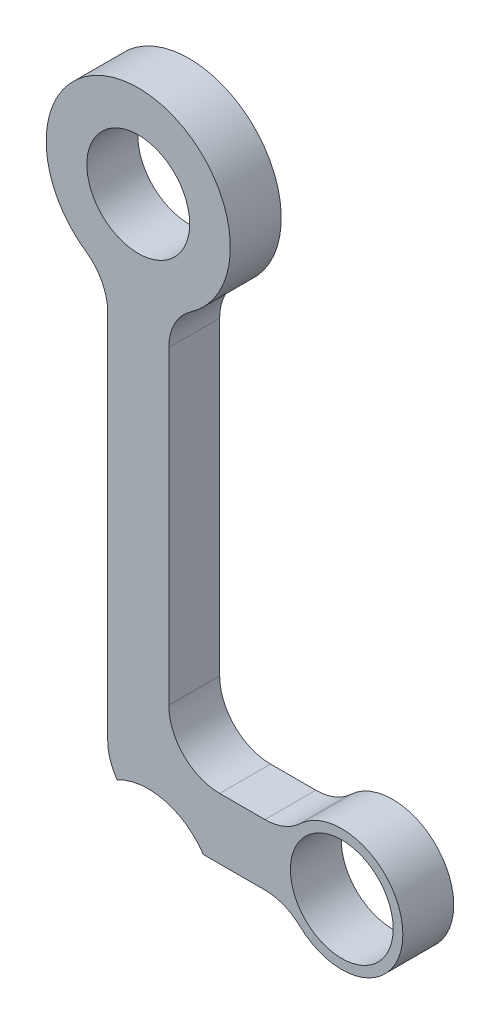
ISO-10303-21;
HEADER;
FILE_DESCRIPTION(('STEP AP214'),'2;1');
FILE_NAME('part.step','',(''),(''),'','','');
FILE_SCHEMA(('AUTOMOTIVE_DESIGN { 1 0 10303 214 1 1 1 1 }'));
ENDSEC;
DATA;
#1=APPLICATION_CONTEXT('core data for automotive mechanical design processes');
#2=APPLICATION_PROTOCOL_DEFINITION('international standard','automotive_design',2000,#1);
#3=PRODUCT_CONTEXT('',#1,'mechanical');
#4=PRODUCT('Part','Part','',(#3));
#5=PRODUCT_RELATED_PRODUCT_CATEGORY('part','',(#4));
#6=PRODUCT_DEFINITION_FORMATION('','',#4);
#7=PRODUCT_DEFINITION_CONTEXT('part definition',#1,'design');
#8=PRODUCT_DEFINITION('design','',#6,#7);
#9=PRODUCT_DEFINITION_SHAPE('','',#8);
#10=(LENGTH_UNIT() NAMED_UNIT(*) SI_UNIT(.MILLI.,.METRE.));
#11=(NAMED_UNIT(*) PLANE_ANGLE_UNIT() SI_UNIT($,.RADIAN.));
#12=(NAMED_UNIT(*) SI_UNIT($,.STERADIAN.) SOLID_ANGLE_UNIT());
#13=UNCERTAINTY_MEASURE_WITH_UNIT(LENGTH_MEASURE(1.E-05),#10,'distance_accuracy_value','');
#14=(GEOMETRIC_REPRESENTATION_CONTEXT(3) GLOBAL_UNCERTAINTY_ASSIGNED_CONTEXT((#13)) GLOBAL_UNIT_ASSIGNED_CONTEXT((#10,
#11,#12)) REPRESENTATION_CONTEXT('',''));
#15=CARTESIAN_POINT('',(0.,0.,0.));
#16=DIRECTION('',(0.,0.,1.));
#17=DIRECTION('',(1.,0.,0.));
#18=AXIS2_PLACEMENT_3D('',#15,#16,#17);
#19=CARTESIAN_POINT('',(10.16,-53.34,6.35));
#20=DIRECTION('',(0.,0.,-1.));
#21=DIRECTION('',(-1.,0.,0.));
#22=AXIS2_PLACEMENT_3D('',#19,#20,#21);
#23=PLANE('',#22);
#24=CARTESIAN_POINT('',(2.54000000000001,-60.96,6.35));
#25=DIRECTION('',(0.,0.,1.));
#26=DIRECTION('',(1.,0.,0.));
#27=AXIS2_PLACEMENT_3D('',#24,#25,#26);
#28=CIRCLE('',#27,6.35);
#29=CARTESIAN_POINT('',(-3.80999999999999,-60.96,6.35));
#30=VERTEX_POINT('',#29);
#31=CARTESIAN_POINT('',(-2.64725321506776,-64.6226362203704,6.35));
#32=VERTEX_POINT('',#31);
#33=EDGE_CURVE('E277',#30,#32,#28,.T.);
#34=ORIENTED_EDGE('',*,*,#33,.T.);
#35=CARTESIAN_POINT('',(1.25406511255299,-71.8975754164441,6.35));
#36=DIRECTION('',(0.,0.,-1.));
#37=DIRECTION('',(-1.,0.,0.));
#38=AXIS2_PLACEMENT_3D('',#35,#36,#37);
#39=CIRCLE('',#38,8.255);
#40=CARTESIAN_POINT('',(8.11694911262448,-67.31,6.35));
#41=VERTEX_POINT('',#40);
#42=EDGE_CURVE('E287',#32,#41,#39,.T.);
#43=ORIENTED_EDGE('',*,*,#42,.T.);
#44=DIRECTION('',(1.,0.,0.));
#45=VECTOR('',#44,1.);
#46=CARTESIAN_POINT('',(2.54000000000001,-67.31,6.35));
#47=LINE('',#46,#45);
#48=CARTESIAN_POINT('',(15.8117102672061,-67.31,6.35));
#49=VERTEX_POINT('',#48);
#50=EDGE_CURVE('E280',#41,#49,#47,.T.);
#51=ORIENTED_EDGE('',*,*,#50,.T.);
#52=CARTESIAN_POINT('',(15.8117102672061,-73.66,6.35));
#53=DIRECTION('',(0.,0.,-1.));
#54=DIRECTION('',(-1.,0.,0.));
#55=AXIS2_PLACEMENT_3D('',#52,#53,#54);
#56=CIRCLE('',#55,6.34999999999999);
#57=CARTESIAN_POINT('',(20.1700237821124,-69.0418181818182,6.35));
#58=VERTEX_POINT('',#57);
#59=EDGE_CURVE('E150',#49,#58,#56,.T.);
#60=ORIENTED_EDGE('',*,*,#59,.T.);
#61=CARTESIAN_POINT('',(25.4,-63.5,6.35));
#62=DIRECTION('',(0.,0.,1.));
#63=DIRECTION('',(1.,0.,0.));
#64=AXIS2_PLACEMENT_3D('',#61,#62,#63);
#65=CIRCLE('',#64,7.62);
#66=CARTESIAN_POINT('',(20.1700237821125,-57.9581818181818,6.35));
#67=VERTEX_POINT('',#66);
#68=EDGE_CURVE('E142',#58,#67,#65,.T.);
#69=ORIENTED_EDGE('',*,*,#68,.T.);
#70=CARTESIAN_POINT('',(15.8117102672062,-53.34,6.35));
#71=DIRECTION('',(0.,0.,-1.));
#72=DIRECTION('',(1.,0.,0.));
#73=AXIS2_PLACEMENT_3D('',#70,#71,#72);
#74=CIRCLE('',#73,6.35);
#75=CARTESIAN_POINT('',(15.8117102672062,-59.69,6.35));
#76=VERTEX_POINT('',#75);
#77=EDGE_CURVE('E147',#67,#76,#74,.T.);
#78=ORIENTED_EDGE('',*,*,#77,.T.);
#79=DIRECTION('',(-1.,0.,0.));
#80=VECTOR('',#79,1.);
#81=CARTESIAN_POINT('',(10.16,-59.69,6.35));
#82=LINE('',#81,#80);
#83=CARTESIAN_POINT('',(10.16,-59.69,6.35));
#84=VERTEX_POINT('',#83);
#85=EDGE_CURVE('E67',#76,#84,#82,.T.);
#86=ORIENTED_EDGE('',*,*,#85,.T.);
#87=CARTESIAN_POINT('',(10.16,-53.34,6.35));
#88=DIRECTION('',(0.,0.,-1.));
#89=DIRECTION('',(-1.,0.,0.));
#90=AXIS2_PLACEMENT_3D('',#87,#88,#89);
#91=CIRCLE('',#90,6.35);
#92=CARTESIAN_POINT('',(3.81000000000001,-53.34,6.35));
#93=VERTEX_POINT('',#92);
#94=EDGE_CURVE('E212',#84,#93,#91,.T.);
#95=ORIENTED_EDGE('',*,*,#94,.T.);
#96=DIRECTION('',(0.,1.,0.));
#97=VECTOR('',#96,1.);
#98=CARTESIAN_POINT('',(3.81,-14.6685,6.35));
#99=LINE('',#98,#97);
#100=CARTESIAN_POINT('',(3.81,-14.6685,6.35));
#101=VERTEX_POINT('',#100);
#102=EDGE_CURVE('E118',#93,#101,#99,.T.);
#103=ORIENTED_EDGE('',*,*,#102,.T.);
#104=CARTESIAN_POINT('',(10.16,-14.6685,6.35));
#105=DIRECTION('',(0.,0.,-1.));
#106=DIRECTION('',(-1.,0.,0.));
#107=AXIS2_PLACEMENT_3D('',#104,#105,#106);
#108=CIRCLE('',#107,6.35);
#109=CARTESIAN_POINT('',(6.54434163701068,-9.44839323843416,6.35));
#110=VERTEX_POINT('',#109);
#111=EDGE_CURVE('E266',#101,#110,#108,.T.);
#112=ORIENTED_EDGE('',*,*,#111,.T.);
#113=CARTESIAN_POINT('',(0.,0.,6.35));
#114=DIRECTION('',(0.,0.,1.));
#115=DIRECTION('',(1.,0.,0.));
#116=AXIS2_PLACEMENT_3D('',#113,#114,#115);
#117=CIRCLE('',#116,11.4935);
#118=CARTESIAN_POINT('',(-6.54434163701067,-9.44839323843416,6.35));
#119=VERTEX_POINT('',#118);
#120=EDGE_CURVE('E262',#110,#119,#117,.T.);
#121=ORIENTED_EDGE('',*,*,#120,.T.);
#122=CARTESIAN_POINT('',(-10.16,-14.6685,6.35));
#123=DIRECTION('',(0.,0.,-1.));
#124=DIRECTION('',(1.,0.,0.));
#125=AXIS2_PLACEMENT_3D('',#122,#123,#124);
#126=CIRCLE('',#125,6.35);
#127=CARTESIAN_POINT('',(-3.81,-14.6685,6.35));
#128=VERTEX_POINT('',#127);
#129=EDGE_CURVE('E265',#119,#128,#126,.T.);
#130=ORIENTED_EDGE('',*,*,#129,.T.);
#131=DIRECTION('',(0.,-1.,0.));
#132=VECTOR('',#131,1.);
#133=CARTESIAN_POINT('',(-3.81,-14.6685,6.35));
#134=LINE('',#133,#132);
#135=EDGE_CURVE('E270',#128,#30,#134,.T.);
#136=ORIENTED_EDGE('',*,*,#135,.T.);
#137=EDGE_LOOP('',(#34,#43,#51,#60,#69,#78,#86,#95,#103,#112,#121,#130,#136));
#138=FACE_BOUND('',#137,.T.);
#139=CARTESIAN_POINT('',(0.,0.,6.35));
#140=DIRECTION('',(0.,0.,1.));
#141=DIRECTION('',(1.,0.,0.));
#142=AXIS2_PLACEMENT_3D('',#139,#140,#141);
#143=CIRCLE('',#142,6.4135);
#144=CARTESIAN_POINT('',(6.4135,0.,6.35));
#145=VERTEX_POINT('',#144);
#146=EDGE_CURVE('E180',#145,#145,#143,.T.);
#147=ORIENTED_EDGE('',*,*,#146,.F.);
#148=EDGE_LOOP('',(#147));
#149=FACE_BOUND('',#148,.T.);
#150=CARTESIAN_POINT('',(25.4,-63.5,6.35));
#151=DIRECTION('',(0.,0.,1.));
#152=DIRECTION('',(1.,0.,0.));
#153=AXIS2_PLACEMENT_3D('',#150,#151,#152);
#154=CIRCLE('',#153,6.4135);
#155=CARTESIAN_POINT('',(31.8135,-63.5,6.35));
#156=VERTEX_POINT('',#155);
#157=EDGE_CURVE('E303',#156,#156,#154,.T.);
#158=ORIENTED_EDGE('',*,*,#157,.F.);
#159=EDGE_LOOP('',(#158));
#160=FACE_BOUND('',#159,.T.);
#161=ADVANCED_FACE('F43',(#138,#149,#160),#23,.F.);
#162=CARTESIAN_POINT('',(10.16,-53.34,0.));
#163=DIRECTION('',(0.,0.,-1.));
#164=DIRECTION('',(-1.,0.,0.));
#165=AXIS2_PLACEMENT_3D('',#162,#163,#164);
#166=PLANE('',#165);
#167=CARTESIAN_POINT('',(1.25406511255299,-71.8975754164441,0.));
#168=DIRECTION('',(0.,0.,-1.));
#169=DIRECTION('',(-1.,0.,0.));
#170=AXIS2_PLACEMENT_3D('',#167,#168,#169);
#171=CIRCLE('',#170,8.255);
#172=CARTESIAN_POINT('',(-2.64725321506776,-64.6226362203704,0.));
#173=VERTEX_POINT('',#172);
#174=CARTESIAN_POINT('',(8.11694911262448,-67.31,0.));
#175=VERTEX_POINT('',#174);
#176=EDGE_CURVE('E59',#173,#175,#171,.T.);
#177=ORIENTED_EDGE('',*,*,#176,.F.);
#178=CARTESIAN_POINT('',(2.54000000000001,-60.96,0.));
#179=DIRECTION('',(0.,0.,1.));
#180=DIRECTION('',(1.,0.,0.));
#181=AXIS2_PLACEMENT_3D('',#178,#179,#180);
#182=CIRCLE('',#181,6.35);
#183=CARTESIAN_POINT('',(-3.80999999999999,-60.96,0.));
#184=VERTEX_POINT('',#183);
#185=EDGE_CURVE('E195',#184,#173,#182,.T.);
#186=ORIENTED_EDGE('',*,*,#185,.F.);
#187=DIRECTION('',(0.,-1.,0.));
#188=VECTOR('',#187,1.);
#189=CARTESIAN_POINT('',(-3.81,-14.6685,0.));
#190=LINE('',#189,#188);
#191=CARTESIAN_POINT('',(-3.81,-14.6685,0.));
#192=VERTEX_POINT('',#191);
#193=EDGE_CURVE('E192',#192,#184,#190,.T.);
#194=ORIENTED_EDGE('',*,*,#193,.F.);
#195=CARTESIAN_POINT('',(-10.16,-14.6685,0.));
#196=DIRECTION('',(0.,0.,-1.));
#197=DIRECTION('',(1.,0.,0.));
#198=AXIS2_PLACEMENT_3D('',#195,#196,#197);
#199=CIRCLE('',#198,6.35);
#200=CARTESIAN_POINT('',(-6.54434163701067,-9.44839323843416,0.));
#201=VERTEX_POINT('',#200);
#202=EDGE_CURVE('E189',#201,#192,#199,.T.);
#203=ORIENTED_EDGE('',*,*,#202,.F.);
#204=CARTESIAN_POINT('',(0.,0.,0.));
#205=DIRECTION('',(0.,0.,1.));
#206=DIRECTION('',(1.,0.,0.));
#207=AXIS2_PLACEMENT_3D('',#204,#205,#206);
#208=CIRCLE('',#207,11.4935);
#209=CARTESIAN_POINT('',(6.54434163701068,-9.44839323843416,0.));
#210=VERTEX_POINT('',#209);
#211=EDGE_CURVE('E186',#210,#201,#208,.T.);
#212=ORIENTED_EDGE('',*,*,#211,.F.);
#213=CARTESIAN_POINT('',(10.16,-14.6685,0.));
#214=DIRECTION('',(0.,0.,-1.));
#215=DIRECTION('',(-1.,0.,0.));
#216=AXIS2_PLACEMENT_3D('',#213,#214,#215);
#217=CIRCLE('',#216,6.35);
#218=CARTESIAN_POINT('',(3.81,-14.6685,0.));
#219=VERTEX_POINT('',#218);
#220=EDGE_CURVE('E183',#219,#210,#217,.T.);
#221=ORIENTED_EDGE('',*,*,#220,.F.);
#222=DIRECTION('',(0.,1.,0.));
#223=VECTOR('',#222,1.);
#224=CARTESIAN_POINT('',(3.81,-14.6685,0.));
#225=LINE('',#224,#223);
#226=CARTESIAN_POINT('',(3.81000000000001,-53.34,0.));
#227=VERTEX_POINT('',#226);
#228=EDGE_CURVE('E179',#227,#219,#225,.T.);
#229=ORIENTED_EDGE('',*,*,#228,.F.);
#230=CARTESIAN_POINT('',(10.16,-53.34,0.));
#231=DIRECTION('',(0.,0.,-1.));
#232=DIRECTION('',(-1.,0.,0.));
#233=AXIS2_PLACEMENT_3D('',#230,#231,#232);
#234=CIRCLE('',#233,6.35);
#235=CARTESIAN_POINT('',(10.16,-59.69,0.));
#236=VERTEX_POINT('',#235);
#237=EDGE_CURVE('E175',#236,#227,#234,.T.);
#238=ORIENTED_EDGE('',*,*,#237,.F.);
#239=DIRECTION('',(-1.,0.,0.));
#240=VECTOR('',#239,1.);
#241=CARTESIAN_POINT('',(10.16,-59.69,0.));
#242=LINE('',#241,#240);
#243=CARTESIAN_POINT('',(15.8117102672062,-59.69,0.));
#244=VERTEX_POINT('',#243);
#245=EDGE_CURVE('E109',#244,#236,#242,.T.);
#246=ORIENTED_EDGE('',*,*,#245,.F.);
#247=CARTESIAN_POINT('',(15.8117102672062,-53.34,0.));
#248=DIRECTION('',(0.,0.,-1.));
#249=DIRECTION('',(1.,0.,0.));
#250=AXIS2_PLACEMENT_3D('',#247,#248,#249);
#251=CIRCLE('',#250,6.35);
#252=CARTESIAN_POINT('',(20.1700237821125,-57.9581818181818,0.));
#253=VERTEX_POINT('',#252);
#254=EDGE_CURVE('E207',#253,#244,#251,.T.);
#255=ORIENTED_EDGE('',*,*,#254,.F.);
#256=CARTESIAN_POINT('',(25.4,-63.5,0.));
#257=DIRECTION('',(0.,0.,1.));
#258=DIRECTION('',(1.,0.,0.));
#259=AXIS2_PLACEMENT_3D('',#256,#257,#258);
#260=CIRCLE('',#259,7.62);
#261=CARTESIAN_POINT('',(20.1700237821124,-69.0418181818182,0.));
#262=VERTEX_POINT('',#261);
#263=EDGE_CURVE('E160',#262,#253,#260,.T.);
#264=ORIENTED_EDGE('',*,*,#263,.F.);
#265=CARTESIAN_POINT('',(15.8117102672061,-73.66,0.));
#266=DIRECTION('',(0.,0.,-1.));
#267=DIRECTION('',(-1.,0.,0.));
#268=AXIS2_PLACEMENT_3D('',#265,#266,#267);
#269=CIRCLE('',#268,6.34999999999999);
#270=CARTESIAN_POINT('',(15.8117102672061,-67.31,0.));
#271=VERTEX_POINT('',#270);
#272=EDGE_CURVE('E202',#271,#262,#269,.T.);
#273=ORIENTED_EDGE('',*,*,#272,.F.);
#274=DIRECTION('',(1.,0.,0.));
#275=VECTOR('',#274,1.);
#276=CARTESIAN_POINT('',(2.54000000000001,-67.31,0.));
#277=LINE('',#276,#275);
#278=EDGE_CURVE('E199',#175,#271,#277,.T.);
#279=ORIENTED_EDGE('',*,*,#278,.F.);
#280=EDGE_LOOP('',(#177,#186,#194,#203,#212,#221,#229,#238,#246,#255,#264,#273,#279));
#281=FACE_BOUND('',#280,.T.);
#282=CARTESIAN_POINT('',(0.,0.,0.));
#283=DIRECTION('',(0.,0.,1.));
#284=DIRECTION('',(1.,0.,0.));
#285=AXIS2_PLACEMENT_3D('',#282,#283,#284);
#286=CIRCLE('',#285,6.4135);
#287=CARTESIAN_POINT('',(6.4135,0.,0.));
#288=VERTEX_POINT('',#287);
#289=EDGE_CURVE('E299',#288,#288,#286,.T.);
#290=ORIENTED_EDGE('',*,*,#289,.T.);
#291=EDGE_LOOP('',(#290));
#292=FACE_BOUND('',#291,.T.);
#293=CARTESIAN_POINT('',(25.4,-63.5,0.));
#294=DIRECTION('',(0.,0.,1.));
#295=DIRECTION('',(1.,0.,0.));
#296=AXIS2_PLACEMENT_3D('',#293,#294,#295);
#297=CIRCLE('',#296,6.4135);
#298=CARTESIAN_POINT('',(31.8135,-63.5,0.));
#299=VERTEX_POINT('',#298);
#300=EDGE_CURVE('E307',#299,#299,#297,.T.);
#301=ORIENTED_EDGE('',*,*,#300,.T.);
#302=EDGE_LOOP('',(#301));
#303=FACE_BOUND('',#302,.T.);
#304=ADVANCED_FACE('F249',(#281,#292,#303),#166,.T.);
#305=CARTESIAN_POINT('',(10.16,-53.34,6.35));
#306=DIRECTION('',(0.,0.,-1.));
#307=DIRECTION('',(-1.,0.,0.));
#308=AXIS2_PLACEMENT_3D('',#305,#306,#307);
#309=CYLINDRICAL_SURFACE('',#308,6.35);
#310=ORIENTED_EDGE('',*,*,#237,.T.);
#311=DIRECTION('',(0.,0.,-1.));
#312=VECTOR('',#311,1.);
#313=CARTESIAN_POINT('',(3.81000000000001,-53.34,6.35));
#314=LINE('',#313,#312);
#315=EDGE_CURVE('E52',#93,#227,#314,.T.);
#316=ORIENTED_EDGE('',*,*,#315,.F.);
#317=ORIENTED_EDGE('',*,*,#94,.F.);
#318=DIRECTION('',(0.,0.,-1.));
#319=VECTOR('',#318,1.);
#320=CARTESIAN_POINT('',(10.16,-59.69,6.35));
#321=LINE('',#320,#319);
#322=EDGE_CURVE('E171',#84,#236,#321,.T.);
#323=ORIENTED_EDGE('',*,*,#322,.T.);
#324=EDGE_LOOP('',(#310,#316,#317,#323));
#325=FACE_BOUND('',#324,.T.);
#326=ADVANCED_FACE('F45',(#325),#309,.F.);
#327=CARTESIAN_POINT('',(3.81,-14.6685,6.35));
#328=DIRECTION('',(-1.,0.,0.));
#329=DIRECTION('',(0.,-1.,0.));
#330=AXIS2_PLACEMENT_3D('',#327,#328,#329);
#331=PLANE('',#330);
#332=ORIENTED_EDGE('',*,*,#228,.T.);
#333=DIRECTION('',(0.,0.,-1.));
#334=VECTOR('',#333,1.);
#335=CARTESIAN_POINT('',(3.81,-14.6685,6.35));
#336=LINE('',#335,#334);
#337=EDGE_CURVE('E239',#101,#219,#336,.T.);
#338=ORIENTED_EDGE('',*,*,#337,.F.);
#339=ORIENTED_EDGE('',*,*,#102,.F.);
#340=ORIENTED_EDGE('',*,*,#315,.T.);
#341=EDGE_LOOP('',(#332,#338,#339,#340));
#342=FACE_BOUND('',#341,.T.);
#343=ADVANCED_FACE('F244',(#342),#331,.F.);
#344=CARTESIAN_POINT('',(10.16,-14.6685,6.35));
#345=DIRECTION('',(0.,0.,-1.));
#346=DIRECTION('',(-1.,0.,0.));
#347=AXIS2_PLACEMENT_3D('',#344,#345,#346);
#348=CYLINDRICAL_SURFACE('',#347,6.35);
#349=ORIENTED_EDGE('',*,*,#220,.T.);
#350=DIRECTION('',(0.,0.,-1.));
#351=VECTOR('',#350,1.);
#352=CARTESIAN_POINT('',(6.54434163701068,-9.44839323843416,6.35));
#353=LINE('',#352,#351);
#354=EDGE_CURVE('E235',#110,#210,#353,.T.);
#355=ORIENTED_EDGE('',*,*,#354,.F.);
#356=ORIENTED_EDGE('',*,*,#111,.F.);
#357=ORIENTED_EDGE('',*,*,#337,.T.);
#358=EDGE_LOOP('',(#349,#355,#356,#357));
#359=FACE_BOUND('',#358,.T.);
#360=ADVANCED_FACE('F256',(#359),#348,.F.);
#361=CARTESIAN_POINT('',(0.,0.,6.35));
#362=DIRECTION('',(0.,0.,-1.));
#363=DIRECTION('',(-1.,0.,0.));
#364=AXIS2_PLACEMENT_3D('',#361,#362,#363);
#365=CYLINDRICAL_SURFACE('',#364,11.4935);
#366=ORIENTED_EDGE('',*,*,#211,.T.);
#367=DIRECTION('',(0.,0.,-1.));
#368=VECTOR('',#367,1.);
#369=CARTESIAN_POINT('',(-6.54434163701067,-9.44839323843416,6.35));
#370=LINE('',#369,#368);
#371=EDGE_CURVE('E231',#119,#201,#370,.T.);
#372=ORIENTED_EDGE('',*,*,#371,.F.);
#373=ORIENTED_EDGE('',*,*,#120,.F.);
#374=ORIENTED_EDGE('',*,*,#354,.T.);
#375=EDGE_LOOP('',(#366,#372,#373,#374));
#376=FACE_BOUND('',#375,.T.);
#377=ADVANCED_FACE('F260',(#376),#365,.T.);
#378=CARTESIAN_POINT('',(-10.16,-14.6685,6.35));
#379=DIRECTION('',(0.,0.,-1.));
#380=DIRECTION('',(-1.,0.,0.));
#381=AXIS2_PLACEMENT_3D('',#378,#379,#380);
#382=CYLINDRICAL_SURFACE('',#381,6.35);
#383=ORIENTED_EDGE('',*,*,#202,.T.);
#384=DIRECTION('',(0.,0.,-1.));
#385=VECTOR('',#384,1.);
#386=CARTESIAN_POINT('',(-3.81,-14.6685,6.35));
#387=LINE('',#386,#385);
#388=EDGE_CURVE('E227',#128,#192,#387,.T.);
#389=ORIENTED_EDGE('',*,*,#388,.F.);
#390=ORIENTED_EDGE('',*,*,#129,.F.);
#391=ORIENTED_EDGE('',*,*,#371,.T.);
#392=EDGE_LOOP('',(#383,#389,#390,#391));
#393=FACE_BOUND('',#392,.T.);
#394=ADVANCED_FACE('F335',(#393),#382,.F.);
#395=CARTESIAN_POINT('',(-3.81,-14.6685,6.35));
#396=DIRECTION('',(1.,0.,0.));
#397=DIRECTION('',(0.,1.,0.));
#398=AXIS2_PLACEMENT_3D('',#395,#396,#397);
#399=PLANE('',#398);
#400=ORIENTED_EDGE('',*,*,#193,.T.);
#401=DIRECTION('',(0.,0.,-1.));
#402=VECTOR('',#401,1.);
#403=CARTESIAN_POINT('',(-3.80999999999999,-60.96,6.35));
#404=LINE('',#403,#402);
#405=EDGE_CURVE('E223',#30,#184,#404,.T.);
#406=ORIENTED_EDGE('',*,*,#405,.F.);
#407=ORIENTED_EDGE('',*,*,#135,.F.);
#408=ORIENTED_EDGE('',*,*,#388,.T.);
#409=EDGE_LOOP('',(#400,#406,#407,#408));
#410=FACE_BOUND('',#409,.T.);
#411=ADVANCED_FACE('F331',(#410),#399,.F.);
#412=CARTESIAN_POINT('',(2.54000000000001,-60.96,6.35));
#413=DIRECTION('',(0.,0.,-1.));
#414=DIRECTION('',(-1.,0.,0.));
#415=AXIS2_PLACEMENT_3D('',#412,#413,#414);
#416=CYLINDRICAL_SURFACE('',#415,6.35);
#417=ORIENTED_EDGE('',*,*,#185,.T.);
#418=DIRECTION('',(0.,0.,-1.));
#419=VECTOR('',#418,1.);
#420=CARTESIAN_POINT('',(-2.64725321506776,-64.6226362203704,3.175));
#421=LINE('',#420,#419);
#422=EDGE_CURVE('E311',#173,#32,#421,.F.);
#423=ORIENTED_EDGE('',*,*,#422,.T.);
#424=ORIENTED_EDGE('',*,*,#33,.F.);
#425=ORIENTED_EDGE('',*,*,#405,.T.);
#426=EDGE_LOOP('',(#417,#423,#424,#425));
#427=FACE_BOUND('',#426,.T.);
#428=ADVANCED_FACE('F324',(#427),#416,.T.);
#429=CARTESIAN_POINT('',(2.54000000000001,-67.31,6.35));
#430=DIRECTION('',(0.,1.,0.));
#431=DIRECTION('',(0.,0.,1.));
#432=AXIS2_PLACEMENT_3D('',#429,#430,#431);
#433=PLANE('',#432);
#434=ORIENTED_EDGE('',*,*,#50,.F.);
#435=DIRECTION('',(0.,0.,-1.));
#436=VECTOR('',#435,1.);
#437=CARTESIAN_POINT('',(8.11694911262448,-67.31,6.35));
#438=LINE('',#437,#436);
#439=EDGE_CURVE('E11',#41,#175,#438,.T.);
#440=ORIENTED_EDGE('',*,*,#439,.T.);
#441=ORIENTED_EDGE('',*,*,#278,.T.);
#442=DIRECTION('',(0.,0.,-1.));
#443=VECTOR('',#442,1.);
#444=CARTESIAN_POINT('',(15.8117102672061,-67.31,6.35));
#445=LINE('',#444,#443);
#446=EDGE_CURVE('E219',#49,#271,#445,.T.);
#447=ORIENTED_EDGE('',*,*,#446,.F.);
#448=EDGE_LOOP('',(#434,#440,#441,#447));
#449=FACE_BOUND('',#448,.T.);
#450=ADVANCED_FACE('F289',(#449),#433,.F.);
#451=CARTESIAN_POINT('',(15.8117102672061,-73.66,6.35));
#452=DIRECTION('',(0.,0.,-1.));
#453=DIRECTION('',(-1.,0.,0.));
#454=AXIS2_PLACEMENT_3D('',#451,#452,#453);
#455=CYLINDRICAL_SURFACE('',#454,6.34999999999999);
#456=ORIENTED_EDGE('',*,*,#272,.T.);
#457=DIRECTION('',(0.,0.,-1.));
#458=VECTOR('',#457,1.);
#459=CARTESIAN_POINT('',(20.1700237821124,-69.0418181818182,6.35));
#460=LINE('',#459,#458);
#461=EDGE_CURVE('E164',#58,#262,#460,.T.);
#462=ORIENTED_EDGE('',*,*,#461,.F.);
#463=ORIENTED_EDGE('',*,*,#59,.F.);
#464=ORIENTED_EDGE('',*,*,#446,.T.);
#465=EDGE_LOOP('',(#456,#462,#463,#464));
#466=FACE_BOUND('',#465,.T.);
#467=ADVANCED_FACE('F293',(#466),#455,.F.);
#468=CARTESIAN_POINT('',(25.4,-63.5,6.35));
#469=DIRECTION('',(0.,0.,-1.));
#470=DIRECTION('',(-1.,0.,0.));
#471=AXIS2_PLACEMENT_3D('',#468,#469,#470);
#472=CYLINDRICAL_SURFACE('',#471,7.62);
#473=ORIENTED_EDGE('',*,*,#263,.T.);
#474=DIRECTION('',(0.,0.,-1.));
#475=VECTOR('',#474,1.);
#476=CARTESIAN_POINT('',(20.1700237821125,-57.9581818181818,6.35));
#477=LINE('',#476,#475);
#478=EDGE_CURVE('E157',#67,#253,#477,.T.);
#479=ORIENTED_EDGE('',*,*,#478,.F.);
#480=ORIENTED_EDGE('',*,*,#68,.F.);
#481=ORIENTED_EDGE('',*,*,#461,.T.);
#482=EDGE_LOOP('',(#473,#479,#480,#481));
#483=FACE_BOUND('',#482,.T.);
#484=ADVANCED_FACE('F158',(#483),#472,.T.);
#485=CARTESIAN_POINT('',(15.8117102672062,-53.34,6.35));
#486=DIRECTION('',(0.,0.,-1.));
#487=DIRECTION('',(-1.,0.,0.));
#488=AXIS2_PLACEMENT_3D('',#485,#486,#487);
#489=CYLINDRICAL_SURFACE('',#488,6.35);
#490=ORIENTED_EDGE('',*,*,#254,.T.);
#491=DIRECTION('',(0.,0.,-1.));
#492=VECTOR('',#491,1.);
#493=CARTESIAN_POINT('',(15.8117102672062,-59.69,6.35));
#494=LINE('',#493,#492);
#495=EDGE_CURVE('E165',#76,#244,#494,.T.);
#496=ORIENTED_EDGE('',*,*,#495,.F.);
#497=ORIENTED_EDGE('',*,*,#77,.F.);
#498=ORIENTED_EDGE('',*,*,#478,.T.);
#499=EDGE_LOOP('',(#490,#496,#497,#498));
#500=FACE_BOUND('',#499,.T.);
#501=ADVANCED_FACE('F167',(#500),#489,.F.);
#502=CARTESIAN_POINT('',(10.16,-59.69,6.35));
#503=DIRECTION('',(0.,-1.,0.));
#504=DIRECTION('',(1.,0.,0.));
#505=AXIS2_PLACEMENT_3D('',#502,#503,#504);
#506=PLANE('',#505);
#507=ORIENTED_EDGE('',*,*,#245,.T.);
#508=ORIENTED_EDGE('',*,*,#322,.F.);
#509=ORIENTED_EDGE('',*,*,#85,.F.);
#510=ORIENTED_EDGE('',*,*,#495,.T.);
#511=EDGE_LOOP('',(#507,#508,#509,#510));
#512=FACE_BOUND('',#511,.T.);
#513=ADVANCED_FACE('F294',(#512),#506,.F.);
#514=CARTESIAN_POINT('',(0.,0.,6.35));
#515=DIRECTION('',(0.,0.,-1.));
#516=DIRECTION('',(-1.,0.,0.));
#517=AXIS2_PLACEMENT_3D('',#514,#515,#516);
#518=CYLINDRICAL_SURFACE('',#517,6.4135);
#519=ORIENTED_EDGE('',*,*,#146,.T.);
#520=EDGE_LOOP('',(#519));
#521=FACE_BOUND('',#520,.T.);
#522=ORIENTED_EDGE('',*,*,#289,.F.);
#523=EDGE_LOOP('',(#522));
#524=FACE_BOUND('',#523,.T.);
#525=ADVANCED_FACE('F351',(#521,#524),#518,.F.);
#526=CARTESIAN_POINT('',(25.4,-63.5,6.35));
#527=DIRECTION('',(0.,0.,-1.));
#528=DIRECTION('',(-1.,0.,0.));
#529=AXIS2_PLACEMENT_3D('',#526,#527,#528);
#530=CYLINDRICAL_SURFACE('',#529,6.4135);
#531=ORIENTED_EDGE('',*,*,#157,.T.);
#532=EDGE_LOOP('',(#531));
#533=FACE_BOUND('',#532,.T.);
#534=ORIENTED_EDGE('',*,*,#300,.F.);
#535=EDGE_LOOP('',(#534));
#536=FACE_BOUND('',#535,.T.);
#537=ADVANCED_FACE('F397',(#533,#536),#530,.F.);
#538=CARTESIAN_POINT('',(1.25406511255299,-71.8975754164441,6.35));
#539=DIRECTION('',(0.,0.,-1.));
#540=DIRECTION('',(-1.,0.,0.));
#541=AXIS2_PLACEMENT_3D('',#538,#539,#540);
#542=CYLINDRICAL_SURFACE('',#541,8.255);
#543=ORIENTED_EDGE('',*,*,#176,.T.);
#544=ORIENTED_EDGE('',*,*,#439,.F.);
#545=ORIENTED_EDGE('',*,*,#42,.F.);
#546=ORIENTED_EDGE('',*,*,#422,.F.);
#547=EDGE_LOOP('',(#543,#544,#545,#546));
#548=FACE_BOUND('',#547,.T.);
#549=ADVANCED_FACE('F404',(#548),#542,.F.);
#550=CLOSED_SHELL('',(#161,#304,#326,#343,#360,#377,#394,#411,#428,#450,#467,#484,#501,#513,
#525,#537,#549));
#551=MANIFOLD_SOLID_BREP('B2',#550);
#552=ADVANCED_BREP_SHAPE_REPRESENTATION('',(#18,#551),#14);
#553=SHAPE_DEFINITION_REPRESENTATION(#9,#552);
ENDSEC;
END-ISO-10303-21;
